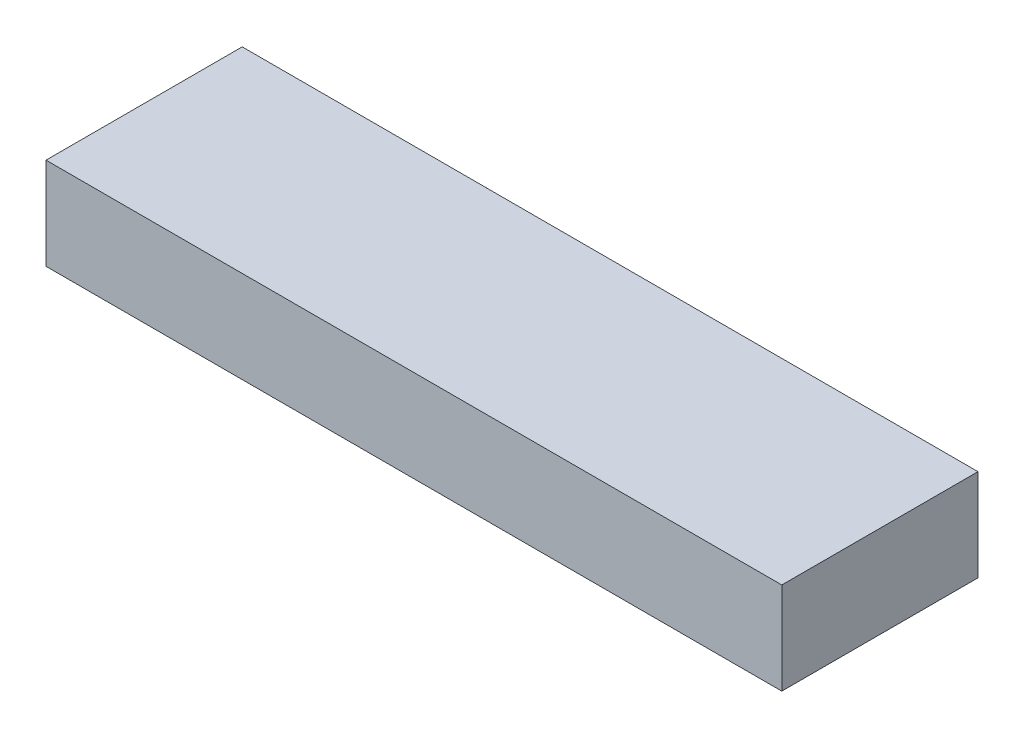
ISO-10303-21;
HEADER;
FILE_DESCRIPTION(('STEP AP214'),'2;1');
FILE_NAME('part.step','',(''),(''),'','','');
FILE_SCHEMA(('AUTOMOTIVE_DESIGN { 1 0 10303 214 1 1 1 1 }'));
ENDSEC;
DATA;
#1=APPLICATION_CONTEXT('core data for automotive mechanical design processes');
#2=APPLICATION_PROTOCOL_DEFINITION('international standard','automotive_design',2000,#1);
#3=PRODUCT_CONTEXT('',#1,'mechanical');
#4=PRODUCT('Part','Part','',(#3));
#5=PRODUCT_RELATED_PRODUCT_CATEGORY('part','',(#4));
#6=PRODUCT_DEFINITION_FORMATION('','',#4);
#7=PRODUCT_DEFINITION_CONTEXT('part definition',#1,'design');
#8=PRODUCT_DEFINITION('design','',#6,#7);
#9=PRODUCT_DEFINITION_SHAPE('','',#8);
#10=(LENGTH_UNIT() NAMED_UNIT(*) SI_UNIT(.MILLI.,.METRE.));
#11=(NAMED_UNIT(*) PLANE_ANGLE_UNIT() SI_UNIT($,.RADIAN.));
#12=(NAMED_UNIT(*) SI_UNIT($,.STERADIAN.) SOLID_ANGLE_UNIT());
#13=UNCERTAINTY_MEASURE_WITH_UNIT(LENGTH_MEASURE(1.E-05),#10,'distance_accuracy_value','');
#14=(GEOMETRIC_REPRESENTATION_CONTEXT(3) GLOBAL_UNCERTAINTY_ASSIGNED_CONTEXT((#13)) GLOBAL_UNIT_ASSIGNED_CONTEXT((#10,
#11,#12)) REPRESENTATION_CONTEXT('',''));
#15=CARTESIAN_POINT('',(0.,0.,0.));
#16=DIRECTION('',(0.,0.,1.));
#17=DIRECTION('',(1.,0.,0.));
#18=AXIS2_PLACEMENT_3D('',#15,#16,#17);
#19=CARTESIAN_POINT('',(0.,4.7625,0.));
#20=DIRECTION('',(1.,0.,0.));
#21=DIRECTION('',(0.,0.,-1.));
#22=AXIS2_PLACEMENT_3D('',#19,#20,#21);
#23=PLANE('',#22);
#24=DIRECTION('',(0.,0.,1.));
#25=VECTOR('',#24,1.);
#26=CARTESIAN_POINT('',(0.,0.,0.));
#27=LINE('',#26,#25);
#28=CARTESIAN_POINT('',(0.,0.,-10.16));
#29=VERTEX_POINT('',#28);
#30=CARTESIAN_POINT('',(0.,0.,0.));
#31=VERTEX_POINT('',#30);
#32=EDGE_CURVE('E111',#29,#31,#27,.T.);
#33=ORIENTED_EDGE('',*,*,#32,.T.);
#34=DIRECTION('',(0.,-1.,0.));
#35=VECTOR('',#34,1.);
#36=CARTESIAN_POINT('',(0.,4.7625,0.));
#37=LINE('',#36,#35);
#38=CARTESIAN_POINT('',(0.,4.7625,0.));
#39=VERTEX_POINT('',#38);
#40=EDGE_CURVE('E11',#39,#31,#37,.T.);
#41=ORIENTED_EDGE('',*,*,#40,.F.);
#42=DIRECTION('',(0.,0.,1.));
#43=VECTOR('',#42,1.);
#44=CARTESIAN_POINT('',(0.,4.7625,0.));
#45=LINE('',#44,#43);
#46=CARTESIAN_POINT('',(0.,4.7625,-10.16));
#47=VERTEX_POINT('',#46);
#48=EDGE_CURVE('E95',#47,#39,#45,.T.);
#49=ORIENTED_EDGE('',*,*,#48,.F.);
#50=DIRECTION('',(0.,-1.,0.));
#51=VECTOR('',#50,1.);
#52=CARTESIAN_POINT('',(0.,4.7625,-10.16));
#53=LINE('',#52,#51);
#54=EDGE_CURVE('E107',#47,#29,#53,.T.);
#55=ORIENTED_EDGE('',*,*,#54,.T.);
#56=EDGE_LOOP('',(#33,#41,#49,#55));
#57=FACE_BOUND('',#56,.T.);
#58=ADVANCED_FACE('F43',(#57),#23,.F.);
#59=CARTESIAN_POINT('',(0.,4.7625,0.));
#60=DIRECTION('',(0.,0.,-1.));
#61=DIRECTION('',(-1.,0.,0.));
#62=AXIS2_PLACEMENT_3D('',#59,#60,#61);
#63=PLANE('',#62);
#64=DIRECTION('',(1.,0.,0.));
#65=VECTOR('',#64,1.);
#66=CARTESIAN_POINT('',(0.,0.,0.));
#67=LINE('',#66,#65);
#68=CARTESIAN_POINT('',(38.1,0.,0.));
#69=VERTEX_POINT('',#68);
#70=EDGE_CURVE('E100',#31,#69,#67,.T.);
#71=ORIENTED_EDGE('',*,*,#70,.T.);
#72=DIRECTION('',(0.,-1.,0.));
#73=VECTOR('',#72,1.);
#74=CARTESIAN_POINT('',(38.1,4.7625,0.));
#75=LINE('',#74,#73);
#76=CARTESIAN_POINT('',(38.1,4.7625,0.));
#77=VERTEX_POINT('',#76);
#78=EDGE_CURVE('E52',#77,#69,#75,.T.);
#79=ORIENTED_EDGE('',*,*,#78,.F.);
#80=DIRECTION('',(1.,0.,0.));
#81=VECTOR('',#80,1.);
#82=CARTESIAN_POINT('',(0.,4.7625,0.));
#83=LINE('',#82,#81);
#84=EDGE_CURVE('E90',#39,#77,#83,.T.);
#85=ORIENTED_EDGE('',*,*,#84,.F.);
#86=ORIENTED_EDGE('',*,*,#40,.T.);
#87=EDGE_LOOP('',(#71,#79,#85,#86));
#88=FACE_BOUND('',#87,.T.);
#89=ADVANCED_FACE('F99',(#88),#63,.F.);
#90=CARTESIAN_POINT('',(38.1,4.7625,0.));
#91=DIRECTION('',(-1.,0.,0.));
#92=DIRECTION('',(0.,0.,1.));
#93=AXIS2_PLACEMENT_3D('',#90,#91,#92);
#94=PLANE('',#93);
#95=DIRECTION('',(0.,0.,-1.));
#96=VECTOR('',#95,1.);
#97=CARTESIAN_POINT('',(38.1,0.,0.));
#98=LINE('',#97,#96);
#99=CARTESIAN_POINT('',(38.1,0.,-10.16));
#100=VERTEX_POINT('',#99);
#101=EDGE_CURVE('E77',#69,#100,#98,.T.);
#102=ORIENTED_EDGE('',*,*,#101,.T.);
#103=DIRECTION('',(0.,-1.,0.));
#104=VECTOR('',#103,1.);
#105=CARTESIAN_POINT('',(38.1,4.7625,-10.16));
#106=LINE('',#105,#104);
#107=CARTESIAN_POINT('',(38.1,4.7625,-10.16));
#108=VERTEX_POINT('',#107);
#109=EDGE_CURVE('E102',#108,#100,#106,.T.);
#110=ORIENTED_EDGE('',*,*,#109,.F.);
#111=DIRECTION('',(0.,0.,-1.));
#112=VECTOR('',#111,1.);
#113=CARTESIAN_POINT('',(38.1,4.7625,0.));
#114=LINE('',#113,#112);
#115=EDGE_CURVE('E93',#77,#108,#114,.T.);
#116=ORIENTED_EDGE('',*,*,#115,.F.);
#117=ORIENTED_EDGE('',*,*,#78,.T.);
#118=EDGE_LOOP('',(#102,#110,#116,#117));
#119=FACE_BOUND('',#118,.T.);
#120=ADVANCED_FACE('F103',(#119),#94,.F.);
#121=CARTESIAN_POINT('',(0.,4.7625,-10.16));
#122=DIRECTION('',(0.,0.,1.));
#123=DIRECTION('',(1.,0.,0.));
#124=AXIS2_PLACEMENT_3D('',#121,#122,#123);
#125=PLANE('',#124);
#126=DIRECTION('',(-1.,0.,0.));
#127=VECTOR('',#126,1.);
#128=CARTESIAN_POINT('',(0.,0.,-10.16));
#129=LINE('',#128,#127);
#130=EDGE_CURVE('E83',#100,#29,#129,.T.);
#131=ORIENTED_EDGE('',*,*,#130,.T.);
#132=ORIENTED_EDGE('',*,*,#54,.F.);
#133=DIRECTION('',(-1.,0.,0.));
#134=VECTOR('',#133,1.);
#135=CARTESIAN_POINT('',(0.,4.7625,-10.16));
#136=LINE('',#135,#134);
#137=EDGE_CURVE('E60',#108,#47,#136,.T.);
#138=ORIENTED_EDGE('',*,*,#137,.F.);
#139=ORIENTED_EDGE('',*,*,#109,.T.);
#140=EDGE_LOOP('',(#131,#132,#138,#139));
#141=FACE_BOUND('',#140,.T.);
#142=ADVANCED_FACE('F124',(#141),#125,.F.);
#143=CARTESIAN_POINT('',(0.,4.7625,0.));
#144=DIRECTION('',(0.,-1.,0.));
#145=DIRECTION('',(0.,0.,-1.));
#146=AXIS2_PLACEMENT_3D('',#143,#144,#145);
#147=PLANE('',#146);
#148=ORIENTED_EDGE('',*,*,#48,.T.);
#149=ORIENTED_EDGE('',*,*,#84,.T.);
#150=ORIENTED_EDGE('',*,*,#115,.T.);
#151=ORIENTED_EDGE('',*,*,#137,.T.);
#152=EDGE_LOOP('',(#148,#149,#150,#151));
#153=FACE_BOUND('',#152,.T.);
#154=ADVANCED_FACE('F91',(#153),#147,.F.);
#155=CARTESIAN_POINT('',(0.,0.,0.));
#156=DIRECTION('',(0.,-1.,0.));
#157=DIRECTION('',(0.,0.,-1.));
#158=AXIS2_PLACEMENT_3D('',#155,#156,#157);
#159=PLANE('',#158);
#160=ORIENTED_EDGE('',*,*,#32,.F.);
#161=ORIENTED_EDGE('',*,*,#130,.F.);
#162=ORIENTED_EDGE('',*,*,#101,.F.);
#163=ORIENTED_EDGE('',*,*,#70,.F.);
#164=EDGE_LOOP('',(#160,#161,#162,#163));
#165=FACE_BOUND('',#164,.T.);
#166=ADVANCED_FACE('F127',(#165),#159,.T.);
#167=CLOSED_SHELL('',(#58,#89,#120,#142,#154,#166));
#168=MANIFOLD_SOLID_BREP('B2',#167);
#169=ADVANCED_BREP_SHAPE_REPRESENTATION('',(#18,#168),#14);
#170=SHAPE_DEFINITION_REPRESENTATION(#9,#169);
ENDSEC;
END-ISO-10303-21;
